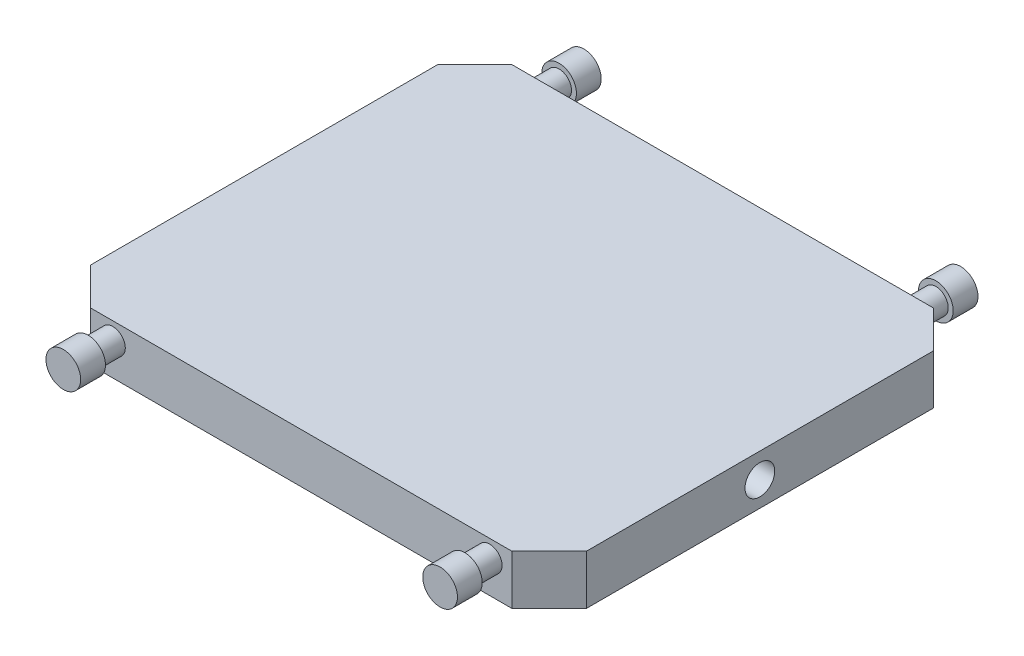
ISO-10303-21;
HEADER;
FILE_DESCRIPTION(('STEP AP214'),'2;1');
FILE_NAME('part.step','',(''),(''),'','','');
FILE_SCHEMA(('AUTOMOTIVE_DESIGN { 1 0 10303 214 1 1 1 1 }'));
ENDSEC;
DATA;
#1=APPLICATION_CONTEXT('core data for automotive mechanical design processes');
#2=APPLICATION_PROTOCOL_DEFINITION('international standard','automotive_design',2000,#1);
#3=PRODUCT_CONTEXT('',#1,'mechanical');
#4=PRODUCT('Part','Part','',(#3));
#5=PRODUCT_RELATED_PRODUCT_CATEGORY('part','',(#4));
#6=PRODUCT_DEFINITION_FORMATION('','',#4);
#7=PRODUCT_DEFINITION_CONTEXT('part definition',#1,'design');
#8=PRODUCT_DEFINITION('design','',#6,#7);
#9=PRODUCT_DEFINITION_SHAPE('','',#8);
#10=(LENGTH_UNIT() NAMED_UNIT(*) SI_UNIT(.MILLI.,.METRE.));
#11=(NAMED_UNIT(*) PLANE_ANGLE_UNIT() SI_UNIT($,.RADIAN.));
#12=(NAMED_UNIT(*) SI_UNIT($,.STERADIAN.) SOLID_ANGLE_UNIT());
#13=UNCERTAINTY_MEASURE_WITH_UNIT(LENGTH_MEASURE(1.E-05),#10,'distance_accuracy_value','');
#14=(GEOMETRIC_REPRESENTATION_CONTEXT(3) GLOBAL_UNCERTAINTY_ASSIGNED_CONTEXT((#13)) GLOBAL_UNIT_ASSIGNED_CONTEXT((#10,
#11,#12)) REPRESENTATION_CONTEXT('',''));
#15=CARTESIAN_POINT('',(0.,0.,0.));
#16=DIRECTION('',(0.,0.,1.));
#17=DIRECTION('',(1.,0.,0.));
#18=AXIS2_PLACEMENT_3D('',#15,#16,#17);
#19=CARTESIAN_POINT('',(0.,40.,-30.));
#20=DIRECTION('',(1.,0.,0.));
#21=DIRECTION('',(0.,0.,-1.));
#22=AXIS2_PLACEMENT_3D('',#19,#20,#21);
#23=PLANE('',#22);
#24=CARTESIAN_POINT('',(0.,20.,-170.));
#25=DIRECTION('',(-1.,0.,0.));
#26=DIRECTION('',(0.,0.,1.));
#27=AXIS2_PLACEMENT_3D('',#24,#25,#26);
#28=CIRCLE('',#27,12.);
#29=CARTESIAN_POINT('',(0.,20.,-158.));
#30=VERTEX_POINT('',#29);
#31=EDGE_CURVE('E191',#30,#30,#28,.T.);
#32=ORIENTED_EDGE('',*,*,#31,.F.);
#33=EDGE_LOOP('',(#32));
#34=FACE_BOUND('',#33,.T.);
#35=DIRECTION('',(0.,0.,1.));
#36=VECTOR('',#35,1.);
#37=CARTESIAN_POINT('',(0.,0.,-30.));
#38=LINE('',#37,#36);
#39=CARTESIAN_POINT('',(0.,0.,-310.));
#40=VERTEX_POINT('',#39);
#41=CARTESIAN_POINT('',(0.,0.,-30.));
#42=VERTEX_POINT('',#41);
#43=EDGE_CURVE('E130',#40,#42,#38,.T.);
#44=ORIENTED_EDGE('',*,*,#43,.T.);
#45=DIRECTION('',(0.,-1.,0.));
#46=VECTOR('',#45,1.);
#47=CARTESIAN_POINT('',(0.,40.,-30.));
#48=LINE('',#47,#46);
#49=CARTESIAN_POINT('',(0.,40.,-30.));
#50=VERTEX_POINT('',#49);
#51=EDGE_CURVE('E158',#50,#42,#48,.T.);
#52=ORIENTED_EDGE('',*,*,#51,.F.);
#53=DIRECTION('',(0.,0.,1.));
#54=VECTOR('',#53,1.);
#55=CARTESIAN_POINT('',(0.,40.,-30.));
#56=LINE('',#55,#54);
#57=CARTESIAN_POINT('',(0.,40.,-310.));
#58=VERTEX_POINT('',#57);
#59=EDGE_CURVE('E145',#58,#50,#56,.T.);
#60=ORIENTED_EDGE('',*,*,#59,.F.);
#61=DIRECTION('',(0.,-1.,0.));
#62=VECTOR('',#61,1.);
#63=CARTESIAN_POINT('',(0.,40.,-310.));
#64=LINE('',#63,#62);
#65=EDGE_CURVE('E126',#58,#40,#64,.T.);
#66=ORIENTED_EDGE('',*,*,#65,.T.);
#67=EDGE_LOOP('',(#44,#52,#60,#66));
#68=FACE_BOUND('',#67,.T.);
#69=ADVANCED_FACE('F33',(#34,#68),#23,.F.);
#70=CARTESIAN_POINT('',(0.,40.,-30.));
#71=DIRECTION('',(0.707106781186548,0.,-0.707106781186548));
#72=DIRECTION('',(-0.707106781186548,0.,-0.707106781186548));
#73=AXIS2_PLACEMENT_3D('',#70,#71,#72);
#74=PLANE('',#73);
#75=DIRECTION('',(0.707106781186547,0.,0.707106781186547));
#76=VECTOR('',#75,1.);
#77=CARTESIAN_POINT('',(0.,0.,-30.));
#78=LINE('',#77,#76);
#79=CARTESIAN_POINT('',(30.,0.,0.));
#80=VERTEX_POINT('',#79);
#81=EDGE_CURVE('E133',#42,#80,#78,.T.);
#82=ORIENTED_EDGE('',*,*,#81,.T.);
#83=DIRECTION('',(0.,-1.,0.));
#84=VECTOR('',#83,1.);
#85=CARTESIAN_POINT('',(30.,40.,0.));
#86=LINE('',#85,#84);
#87=CARTESIAN_POINT('',(30.,40.,0.));
#88=VERTEX_POINT('',#87);
#89=EDGE_CURVE('E155',#88,#80,#86,.T.);
#90=ORIENTED_EDGE('',*,*,#89,.F.);
#91=DIRECTION('',(0.707106781186547,0.,0.707106781186547));
#92=VECTOR('',#91,1.);
#93=CARTESIAN_POINT('',(0.,40.,-30.));
#94=LINE('',#93,#92);
#95=EDGE_CURVE('E93',#50,#88,#94,.T.);
#96=ORIENTED_EDGE('',*,*,#95,.F.);
#97=ORIENTED_EDGE('',*,*,#51,.T.);
#98=EDGE_LOOP('',(#82,#90,#96,#97));
#99=FACE_BOUND('',#98,.T.);
#100=ADVANCED_FACE('F168',(#99),#74,.F.);
#101=CARTESIAN_POINT('',(30.,40.,0.));
#102=DIRECTION('',(0.,0.,-1.));
#103=DIRECTION('',(-1.,0.,0.));
#104=AXIS2_PLACEMENT_3D('',#101,#102,#103);
#105=PLANE('',#104);
#106=CARTESIAN_POINT('',(352.,26.,0.));
#107=DIRECTION('',(0.,0.,-1.));
#108=DIRECTION('',(-1.,0.,0.));
#109=AXIS2_PLACEMENT_3D('',#106,#107,#108);
#110=CIRCLE('',#109,9.99999999999993);
#111=CARTESIAN_POINT('',(342.,26.,0.));
#112=VERTEX_POINT('',#111);
#113=EDGE_CURVE('E11',#112,#112,#110,.F.);
#114=ORIENTED_EDGE('',*,*,#113,.F.);
#115=EDGE_LOOP('',(#114));
#116=FACE_BOUND('',#115,.T.);
#117=CARTESIAN_POINT('',(48.,26.,0.));
#118=DIRECTION('',(0.,0.,-1.));
#119=DIRECTION('',(-1.,0.,0.));
#120=AXIS2_PLACEMENT_3D('',#117,#118,#119);
#121=CIRCLE('',#120,10.);
#122=CARTESIAN_POINT('',(38.,26.,0.));
#123=VERTEX_POINT('',#122);
#124=EDGE_CURVE('E41',#123,#123,#121,.F.);
#125=ORIENTED_EDGE('',*,*,#124,.F.);
#126=EDGE_LOOP('',(#125));
#127=FACE_BOUND('',#126,.T.);
#128=DIRECTION('',(1.,0.,0.));
#129=VECTOR('',#128,1.);
#130=CARTESIAN_POINT('',(30.,0.,0.));
#131=LINE('',#130,#129);
#132=CARTESIAN_POINT('',(370.,0.,0.));
#133=VERTEX_POINT('',#132);
#134=EDGE_CURVE('E136',#80,#133,#131,.T.);
#135=ORIENTED_EDGE('',*,*,#134,.T.);
#136=DIRECTION('',(0.,-1.,0.));
#137=VECTOR('',#136,1.);
#138=CARTESIAN_POINT('',(370.,40.,0.));
#139=LINE('',#138,#137);
#140=CARTESIAN_POINT('',(370.,40.,0.));
#141=VERTEX_POINT('',#140);
#142=EDGE_CURVE('E152',#141,#133,#139,.T.);
#143=ORIENTED_EDGE('',*,*,#142,.F.);
#144=DIRECTION('',(1.,0.,0.));
#145=VECTOR('',#144,1.);
#146=CARTESIAN_POINT('',(30.,40.,0.));
#147=LINE('',#146,#145);
#148=EDGE_CURVE('E185',#88,#141,#147,.T.);
#149=ORIENTED_EDGE('',*,*,#148,.F.);
#150=ORIENTED_EDGE('',*,*,#89,.T.);
#151=EDGE_LOOP('',(#135,#143,#149,#150));
#152=FACE_BOUND('',#151,.T.);
#153=ADVANCED_FACE('F164',(#116,#127,#152),#105,.F.);
#154=CARTESIAN_POINT('',(370.,40.,0.));
#155=DIRECTION('',(-0.707106781186547,0.,-0.707106781186548));
#156=DIRECTION('',(-0.707106781186548,0.,0.707106781186547));
#157=AXIS2_PLACEMENT_3D('',#154,#155,#156);
#158=PLANE('',#157);
#159=DIRECTION('',(0.707106781186548,0.,-0.707106781186547));
#160=VECTOR('',#159,1.);
#161=CARTESIAN_POINT('',(370.,0.,0.));
#162=LINE('',#161,#160);
#163=CARTESIAN_POINT('',(400.,0.,-30.));
#164=VERTEX_POINT('',#163);
#165=EDGE_CURVE('E138',#133,#164,#162,.T.);
#166=ORIENTED_EDGE('',*,*,#165,.T.);
#167=DIRECTION('',(0.,-1.,0.));
#168=VECTOR('',#167,1.);
#169=CARTESIAN_POINT('',(400.,40.,-30.));
#170=LINE('',#169,#168);
#171=CARTESIAN_POINT('',(400.,40.,-30.));
#172=VERTEX_POINT('',#171);
#173=EDGE_CURVE('E149',#172,#164,#170,.T.);
#174=ORIENTED_EDGE('',*,*,#173,.F.);
#175=DIRECTION('',(0.707106781186548,0.,-0.707106781186547));
#176=VECTOR('',#175,1.);
#177=CARTESIAN_POINT('',(370.,40.,0.));
#178=LINE('',#177,#176);
#179=EDGE_CURVE('E179',#141,#172,#178,.T.);
#180=ORIENTED_EDGE('',*,*,#179,.F.);
#181=ORIENTED_EDGE('',*,*,#142,.T.);
#182=EDGE_LOOP('',(#166,#174,#180,#181));
#183=FACE_BOUND('',#182,.T.);
#184=ADVANCED_FACE('F167',(#183),#158,.F.);
#185=CARTESIAN_POINT('',(400.,40.,-30.));
#186=DIRECTION('',(-1.,0.,0.));
#187=DIRECTION('',(0.,0.,1.));
#188=AXIS2_PLACEMENT_3D('',#185,#186,#187);
#189=PLANE('',#188);
#190=CARTESIAN_POINT('',(400.,20.,-170.));
#191=DIRECTION('',(-1.,0.,0.));
#192=DIRECTION('',(0.,0.,1.));
#193=AXIS2_PLACEMENT_3D('',#190,#191,#192);
#194=CIRCLE('',#193,12.);
#195=CARTESIAN_POINT('',(400.,20.,-158.));
#196=VERTEX_POINT('',#195);
#197=EDGE_CURVE('E134',#196,#196,#194,.T.);
#198=ORIENTED_EDGE('',*,*,#197,.T.);
#199=EDGE_LOOP('',(#198));
#200=FACE_BOUND('',#199,.T.);
#201=DIRECTION('',(0.,0.,-1.));
#202=VECTOR('',#201,1.);
#203=CARTESIAN_POINT('',(400.,0.,-30.));
#204=LINE('',#203,#202);
#205=CARTESIAN_POINT('',(400.,0.,-310.));
#206=VERTEX_POINT('',#205);
#207=EDGE_CURVE('E140',#164,#206,#204,.T.);
#208=ORIENTED_EDGE('',*,*,#207,.T.);
#209=DIRECTION('',(0.,-1.,0.));
#210=VECTOR('',#209,1.);
#211=CARTESIAN_POINT('',(400.,40.,-310.));
#212=LINE('',#211,#210);
#213=CARTESIAN_POINT('',(400.,40.,-310.));
#214=VERTEX_POINT('',#213);
#215=EDGE_CURVE('E121',#214,#206,#212,.T.);
#216=ORIENTED_EDGE('',*,*,#215,.F.);
#217=DIRECTION('',(0.,0.,-1.));
#218=VECTOR('',#217,1.);
#219=CARTESIAN_POINT('',(400.,40.,-30.));
#220=LINE('',#219,#218);
#221=EDGE_CURVE('E112',#172,#214,#220,.T.);
#222=ORIENTED_EDGE('',*,*,#221,.F.);
#223=ORIENTED_EDGE('',*,*,#173,.T.);
#224=EDGE_LOOP('',(#208,#216,#222,#223));
#225=FACE_BOUND('',#224,.T.);
#226=ADVANCED_FACE('F184',(#200,#225),#189,.F.);
#227=CARTESIAN_POINT('',(370.,40.,-340.));
#228=DIRECTION('',(-0.707106781186547,0.,0.707106781186548));
#229=DIRECTION('',(0.707106781186548,0.,0.707106781186547));
#230=AXIS2_PLACEMENT_3D('',#227,#228,#229);
#231=PLANE('',#230);
#232=DIRECTION('',(-0.707106781186548,0.,-0.707106781186547));
#233=VECTOR('',#232,1.);
#234=CARTESIAN_POINT('',(370.,0.,-340.));
#235=LINE('',#234,#233);
#236=CARTESIAN_POINT('',(370.,0.,-340.));
#237=VERTEX_POINT('',#236);
#238=EDGE_CURVE('E120',#206,#237,#235,.T.);
#239=ORIENTED_EDGE('',*,*,#238,.T.);
#240=DIRECTION('',(0.,-1.,0.));
#241=VECTOR('',#240,1.);
#242=CARTESIAN_POINT('',(370.,40.,-340.));
#243=LINE('',#242,#241);
#244=CARTESIAN_POINT('',(370.,40.,-340.));
#245=VERTEX_POINT('',#244);
#246=EDGE_CURVE('E117',#245,#237,#243,.T.);
#247=ORIENTED_EDGE('',*,*,#246,.F.);
#248=DIRECTION('',(-0.707106781186548,0.,-0.707106781186547));
#249=VECTOR('',#248,1.);
#250=CARTESIAN_POINT('',(370.,40.,-340.));
#251=LINE('',#250,#249);
#252=EDGE_CURVE('E106',#214,#245,#251,.T.);
#253=ORIENTED_EDGE('',*,*,#252,.F.);
#254=ORIENTED_EDGE('',*,*,#215,.T.);
#255=EDGE_LOOP('',(#239,#247,#253,#254));
#256=FACE_BOUND('',#255,.T.);
#257=ADVANCED_FACE('F118',(#256),#231,.F.);
#258=CARTESIAN_POINT('',(30.,40.,-340.));
#259=DIRECTION('',(0.,0.,1.));
#260=DIRECTION('',(1.,0.,0.));
#261=AXIS2_PLACEMENT_3D('',#258,#259,#260);
#262=PLANE('',#261);
#263=CARTESIAN_POINT('',(352.,26.,-340.));
#264=DIRECTION('',(0.,0.,1.));
#265=DIRECTION('',(-1.,0.,0.));
#266=AXIS2_PLACEMENT_3D('',#263,#264,#265);
#267=CIRCLE('',#266,9.99999999999993);
#268=CARTESIAN_POINT('',(342.,26.,-340.));
#269=VERTEX_POINT('',#268);
#270=EDGE_CURVE('E217',#269,#269,#267,.T.);
#271=ORIENTED_EDGE('',*,*,#270,.T.);
#272=EDGE_LOOP('',(#271));
#273=FACE_BOUND('',#272,.T.);
#274=CARTESIAN_POINT('',(48.,26.,-340.));
#275=DIRECTION('',(0.,0.,1.));
#276=DIRECTION('',(1.,0.,0.));
#277=AXIS2_PLACEMENT_3D('',#274,#275,#276);
#278=CIRCLE('',#277,10.);
#279=CARTESIAN_POINT('',(58.,26.,-340.));
#280=VERTEX_POINT('',#279);
#281=EDGE_CURVE('E212',#280,#280,#278,.T.);
#282=ORIENTED_EDGE('',*,*,#281,.T.);
#283=EDGE_LOOP('',(#282));
#284=FACE_BOUND('',#283,.T.);
#285=DIRECTION('',(-1.,0.,0.));
#286=VECTOR('',#285,1.);
#287=CARTESIAN_POINT('',(30.,0.,-340.));
#288=LINE('',#287,#286);
#289=CARTESIAN_POINT('',(30.,0.,-340.));
#290=VERTEX_POINT('',#289);
#291=EDGE_CURVE('E78',#237,#290,#288,.T.);
#292=ORIENTED_EDGE('',*,*,#291,.T.);
#293=DIRECTION('',(0.,-1.,0.));
#294=VECTOR('',#293,1.);
#295=CARTESIAN_POINT('',(30.,40.,-340.));
#296=LINE('',#295,#294);
#297=CARTESIAN_POINT('',(30.,40.,-340.));
#298=VERTEX_POINT('',#297);
#299=EDGE_CURVE('E122',#298,#290,#296,.T.);
#300=ORIENTED_EDGE('',*,*,#299,.F.);
#301=DIRECTION('',(-1.,0.,0.));
#302=VECTOR('',#301,1.);
#303=CARTESIAN_POINT('',(30.,40.,-340.));
#304=LINE('',#303,#302);
#305=EDGE_CURVE('E110',#245,#298,#304,.T.);
#306=ORIENTED_EDGE('',*,*,#305,.F.);
#307=ORIENTED_EDGE('',*,*,#246,.T.);
#308=EDGE_LOOP('',(#292,#300,#306,#307));
#309=FACE_BOUND('',#308,.T.);
#310=ADVANCED_FACE('F124',(#273,#284,#309),#262,.F.);
#311=CARTESIAN_POINT('',(0.,40.,-310.));
#312=DIRECTION('',(0.707106781186547,0.,0.707106781186548));
#313=DIRECTION('',(0.707106781186548,0.,-0.707106781186547));
#314=AXIS2_PLACEMENT_3D('',#311,#312,#313);
#315=PLANE('',#314);
#316=DIRECTION('',(-0.707106781186548,0.,0.707106781186547));
#317=VECTOR('',#316,1.);
#318=CARTESIAN_POINT('',(0.,0.,-310.));
#319=LINE('',#318,#317);
#320=EDGE_CURVE('E84',#290,#40,#319,.T.);
#321=ORIENTED_EDGE('',*,*,#320,.T.);
#322=ORIENTED_EDGE('',*,*,#65,.F.);
#323=DIRECTION('',(-0.707106781186548,0.,0.707106781186547));
#324=VECTOR('',#323,1.);
#325=CARTESIAN_POINT('',(0.,40.,-310.));
#326=LINE('',#325,#324);
#327=EDGE_CURVE('E49',#298,#58,#326,.T.);
#328=ORIENTED_EDGE('',*,*,#327,.F.);
#329=ORIENTED_EDGE('',*,*,#299,.T.);
#330=EDGE_LOOP('',(#321,#322,#328,#329));
#331=FACE_BOUND('',#330,.T.);
#332=ADVANCED_FACE('F263',(#331),#315,.F.);
#333=CARTESIAN_POINT('',(0.,40.,0.));
#334=DIRECTION('',(0.,-1.,0.));
#335=DIRECTION('',(0.,0.,-1.));
#336=AXIS2_PLACEMENT_3D('',#333,#334,#335);
#337=PLANE('',#336);
#338=ORIENTED_EDGE('',*,*,#59,.T.);
#339=ORIENTED_EDGE('',*,*,#95,.T.);
#340=ORIENTED_EDGE('',*,*,#148,.T.);
#341=ORIENTED_EDGE('',*,*,#179,.T.);
#342=ORIENTED_EDGE('',*,*,#221,.T.);
#343=ORIENTED_EDGE('',*,*,#252,.T.);
#344=ORIENTED_EDGE('',*,*,#305,.T.);
#345=ORIENTED_EDGE('',*,*,#327,.T.);
#346=EDGE_LOOP('',(#338,#339,#340,#341,#342,#343,#344,#345));
#347=FACE_BOUND('',#346,.T.);
#348=ADVANCED_FACE('F108',(#347),#337,.F.);
#349=CARTESIAN_POINT('',(0.,0.,0.));
#350=DIRECTION('',(0.,-1.,0.));
#351=DIRECTION('',(0.,0.,-1.));
#352=AXIS2_PLACEMENT_3D('',#349,#350,#351);
#353=PLANE('',#352);
#354=ORIENTED_EDGE('',*,*,#43,.F.);
#355=ORIENTED_EDGE('',*,*,#320,.F.);
#356=ORIENTED_EDGE('',*,*,#291,.F.);
#357=ORIENTED_EDGE('',*,*,#238,.F.);
#358=ORIENTED_EDGE('',*,*,#207,.F.);
#359=ORIENTED_EDGE('',*,*,#165,.F.);
#360=ORIENTED_EDGE('',*,*,#134,.F.);
#361=ORIENTED_EDGE('',*,*,#81,.F.);
#362=EDGE_LOOP('',(#354,#355,#356,#357,#358,#359,#360,#361));
#363=FACE_BOUND('',#362,.T.);
#364=ADVANCED_FACE('F182',(#363),#353,.T.);
#365=CARTESIAN_POINT('',(400.,20.,-170.));
#366=DIRECTION('',(-1.,0.,0.));
#367=DIRECTION('',(0.,0.,1.));
#368=AXIS2_PLACEMENT_3D('',#365,#366,#367);
#369=CYLINDRICAL_SURFACE('',#368,12.);
#370=ORIENTED_EDGE('',*,*,#197,.F.);
#371=EDGE_LOOP('',(#370));
#372=FACE_BOUND('',#371,.T.);
#373=ORIENTED_EDGE('',*,*,#31,.T.);
#374=EDGE_LOOP('',(#373));
#375=FACE_BOUND('',#374,.T.);
#376=ADVANCED_FACE('F406',(#372,#375),#369,.F.);
#377=CARTESIAN_POINT('',(48.,26.,20.));
#378=DIRECTION('',(0.,0.,-1.));
#379=DIRECTION('',(-1.,0.,0.));
#380=AXIS2_PLACEMENT_3D('',#377,#378,#379);
#381=CYLINDRICAL_SURFACE('',#380,10.);
#382=CARTESIAN_POINT('',(48.,26.,20.));
#383=DIRECTION('',(0.,0.,1.));
#384=DIRECTION('',(1.,0.,0.));
#385=AXIS2_PLACEMENT_3D('',#382,#383,#384);
#386=CIRCLE('',#385,10.);
#387=CARTESIAN_POINT('',(58.,26.,20.));
#388=VERTEX_POINT('',#387);
#389=EDGE_CURVE('E194',#388,#388,#386,.T.);
#390=ORIENTED_EDGE('',*,*,#389,.F.);
#391=EDGE_LOOP('',(#390));
#392=FACE_BOUND('',#391,.T.);
#393=ORIENTED_EDGE('',*,*,#124,.T.);
#394=EDGE_LOOP('',(#393));
#395=FACE_BOUND('',#394,.T.);
#396=ADVANCED_FACE('F162',(#392,#395),#381,.T.);
#397=CARTESIAN_POINT('',(352.,26.,20.));
#398=DIRECTION('',(0.,0.,-1.));
#399=DIRECTION('',(-1.,0.,0.));
#400=AXIS2_PLACEMENT_3D('',#397,#398,#399);
#401=CYLINDRICAL_SURFACE('',#400,9.99999999999993);
#402=CARTESIAN_POINT('',(352.,26.,20.));
#403=DIRECTION('',(0.,0.,1.));
#404=DIRECTION('',(-1.,0.,0.));
#405=AXIS2_PLACEMENT_3D('',#402,#403,#404);
#406=CIRCLE('',#405,9.99999999999993);
#407=CARTESIAN_POINT('',(342.,26.,20.));
#408=VERTEX_POINT('',#407);
#409=EDGE_CURVE('E199',#408,#408,#406,.T.);
#410=ORIENTED_EDGE('',*,*,#409,.F.);
#411=EDGE_LOOP('',(#410));
#412=FACE_BOUND('',#411,.T.);
#413=ORIENTED_EDGE('',*,*,#113,.T.);
#414=EDGE_LOOP('',(#413));
#415=FACE_BOUND('',#414,.T.);
#416=ADVANCED_FACE('F399',(#412,#415),#401,.T.);
#417=CARTESIAN_POINT('',(48.,26.,40.));
#418=DIRECTION('',(0.,0.,-1.));
#419=DIRECTION('',(-1.,0.,0.));
#420=AXIS2_PLACEMENT_3D('',#417,#418,#419);
#421=CYLINDRICAL_SURFACE('',#420,14.);
#422=CARTESIAN_POINT('',(48.,26.,40.));
#423=DIRECTION('',(0.,0.,1.));
#424=DIRECTION('',(1.,0.,0.));
#425=AXIS2_PLACEMENT_3D('',#422,#423,#424);
#426=CIRCLE('',#425,14.);
#427=CARTESIAN_POINT('',(62.,26.,40.));
#428=VERTEX_POINT('',#427);
#429=EDGE_CURVE('E202',#428,#428,#426,.T.);
#430=ORIENTED_EDGE('',*,*,#429,.F.);
#431=EDGE_LOOP('',(#430));
#432=FACE_BOUND('',#431,.T.);
#433=CARTESIAN_POINT('',(48.,26.,20.));
#434=DIRECTION('',(0.,0.,1.));
#435=DIRECTION('',(1.,0.,0.));
#436=AXIS2_PLACEMENT_3D('',#433,#434,#435);
#437=CIRCLE('',#436,14.);
#438=CARTESIAN_POINT('',(62.,26.,20.));
#439=VERTEX_POINT('',#438);
#440=EDGE_CURVE('E203',#439,#439,#437,.T.);
#441=ORIENTED_EDGE('',*,*,#440,.T.);
#442=EDGE_LOOP('',(#441));
#443=FACE_BOUND('',#442,.T.);
#444=ADVANCED_FACE('F392',(#432,#443),#421,.T.);
#445=CARTESIAN_POINT('',(48.,26.,40.));
#446=DIRECTION('',(0.,0.,1.));
#447=DIRECTION('',(1.,0.,0.));
#448=AXIS2_PLACEMENT_3D('',#445,#446,#447);
#449=PLANE('',#448);
#450=ORIENTED_EDGE('',*,*,#429,.T.);
#451=EDGE_LOOP('',(#450));
#452=FACE_BOUND('',#451,.T.);
#453=ADVANCED_FACE('F389',(#452),#449,.T.);
#454=CARTESIAN_POINT('',(48.,26.,20.));
#455=DIRECTION('',(0.,0.,1.));
#456=DIRECTION('',(1.,0.,0.));
#457=AXIS2_PLACEMENT_3D('',#454,#455,#456);
#458=PLANE('',#457);
#459=ORIENTED_EDGE('',*,*,#389,.T.);
#460=EDGE_LOOP('',(#459));
#461=FACE_BOUND('',#460,.T.);
#462=ORIENTED_EDGE('',*,*,#440,.F.);
#463=EDGE_LOOP('',(#462));
#464=FACE_BOUND('',#463,.T.);
#465=ADVANCED_FACE('F387',(#461,#464),#458,.F.);
#466=CARTESIAN_POINT('',(352.,26.,40.));
#467=DIRECTION('',(0.,0.,-1.));
#468=DIRECTION('',(-1.,0.,0.));
#469=AXIS2_PLACEMENT_3D('',#466,#467,#468);
#470=CYLINDRICAL_SURFACE('',#469,14.);
#471=CARTESIAN_POINT('',(352.,26.,40.));
#472=DIRECTION('',(0.,0.,1.));
#473=DIRECTION('',(1.,0.,0.));
#474=AXIS2_PLACEMENT_3D('',#471,#472,#473);
#475=CIRCLE('',#474,14.);
#476=CARTESIAN_POINT('',(366.,26.,40.));
#477=VERTEX_POINT('',#476);
#478=EDGE_CURVE('E206',#477,#477,#475,.T.);
#479=ORIENTED_EDGE('',*,*,#478,.F.);
#480=EDGE_LOOP('',(#479));
#481=FACE_BOUND('',#480,.T.);
#482=CARTESIAN_POINT('',(352.,26.,20.));
#483=DIRECTION('',(0.,0.,1.));
#484=DIRECTION('',(1.,0.,0.));
#485=AXIS2_PLACEMENT_3D('',#482,#483,#484);
#486=CIRCLE('',#485,14.);
#487=CARTESIAN_POINT('',(366.,26.,20.));
#488=VERTEX_POINT('',#487);
#489=EDGE_CURVE('E209',#488,#488,#486,.T.);
#490=ORIENTED_EDGE('',*,*,#489,.T.);
#491=EDGE_LOOP('',(#490));
#492=FACE_BOUND('',#491,.T.);
#493=ADVANCED_FACE('F381',(#481,#492),#470,.T.);
#494=CARTESIAN_POINT('',(352.,26.,40.));
#495=DIRECTION('',(0.,0.,1.));
#496=DIRECTION('',(1.,0.,0.));
#497=AXIS2_PLACEMENT_3D('',#494,#495,#496);
#498=PLANE('',#497);
#499=ORIENTED_EDGE('',*,*,#478,.T.);
#500=EDGE_LOOP('',(#499));
#501=FACE_BOUND('',#500,.T.);
#502=ADVANCED_FACE('F378',(#501),#498,.T.);
#503=CARTESIAN_POINT('',(352.,26.,20.));
#504=DIRECTION('',(0.,0.,1.));
#505=DIRECTION('',(1.,0.,0.));
#506=AXIS2_PLACEMENT_3D('',#503,#504,#505);
#507=PLANE('',#506);
#508=ORIENTED_EDGE('',*,*,#409,.T.);
#509=EDGE_LOOP('',(#508));
#510=FACE_BOUND('',#509,.T.);
#511=ORIENTED_EDGE('',*,*,#489,.F.);
#512=EDGE_LOOP('',(#511));
#513=FACE_BOUND('',#512,.T.);
#514=ADVANCED_FACE('F306',(#510,#513),#507,.F.);
#515=CARTESIAN_POINT('',(48.,26.,-360.));
#516=DIRECTION('',(0.,0.,1.));
#517=DIRECTION('',(1.,0.,0.));
#518=AXIS2_PLACEMENT_3D('',#515,#516,#517);
#519=CYLINDRICAL_SURFACE('',#518,10.);
#520=CARTESIAN_POINT('',(48.,26.,-360.));
#521=DIRECTION('',(0.,0.,-1.));
#522=DIRECTION('',(-1.,0.,0.));
#523=AXIS2_PLACEMENT_3D('',#520,#521,#522);
#524=CIRCLE('',#523,10.);
#525=CARTESIAN_POINT('',(38.,26.,-360.));
#526=VERTEX_POINT('',#525);
#527=EDGE_CURVE('E220',#526,#526,#524,.F.);
#528=ORIENTED_EDGE('',*,*,#527,.T.);
#529=EDGE_LOOP('',(#528));
#530=FACE_BOUND('',#529,.T.);
#531=ORIENTED_EDGE('',*,*,#281,.F.);
#532=EDGE_LOOP('',(#531));
#533=FACE_BOUND('',#532,.T.);
#534=ADVANCED_FACE('F311',(#530,#533),#519,.T.);
#535=CARTESIAN_POINT('',(352.,26.,-360.));
#536=DIRECTION('',(0.,0.,1.));
#537=DIRECTION('',(1.,0.,0.));
#538=AXIS2_PLACEMENT_3D('',#535,#536,#537);
#539=CYLINDRICAL_SURFACE('',#538,9.99999999999993);
#540=CARTESIAN_POINT('',(352.,26.,-360.));
#541=DIRECTION('',(0.,0.,-1.));
#542=DIRECTION('',(-1.,0.,0.));
#543=AXIS2_PLACEMENT_3D('',#540,#541,#542);
#544=CIRCLE('',#543,9.99999999999993);
#545=CARTESIAN_POINT('',(342.,26.,-360.));
#546=VERTEX_POINT('',#545);
#547=EDGE_CURVE('E227',#546,#546,#544,.F.);
#548=ORIENTED_EDGE('',*,*,#547,.T.);
#549=EDGE_LOOP('',(#548));
#550=FACE_BOUND('',#549,.T.);
#551=ORIENTED_EDGE('',*,*,#270,.F.);
#552=EDGE_LOOP('',(#551));
#553=FACE_BOUND('',#552,.T.);
#554=ADVANCED_FACE('F316',(#550,#553),#539,.T.);
#555=CARTESIAN_POINT('',(48.,26.,-380.));
#556=DIRECTION('',(0.,0.,1.));
#557=DIRECTION('',(1.,0.,0.));
#558=AXIS2_PLACEMENT_3D('',#555,#556,#557);
#559=CYLINDRICAL_SURFACE('',#558,14.);
#560=CARTESIAN_POINT('',(48.,26.,-380.));
#561=DIRECTION('',(0.,0.,1.));
#562=DIRECTION('',(1.,0.,0.));
#563=AXIS2_PLACEMENT_3D('',#560,#561,#562);
#564=CIRCLE('',#563,14.);
#565=CARTESIAN_POINT('',(62.,26.,-380.));
#566=VERTEX_POINT('',#565);
#567=EDGE_CURVE('E223',#566,#566,#564,.T.);
#568=ORIENTED_EDGE('',*,*,#567,.T.);
#569=EDGE_LOOP('',(#568));
#570=FACE_BOUND('',#569,.T.);
#571=CARTESIAN_POINT('',(48.,26.,-360.));
#572=DIRECTION('',(0.,0.,1.));
#573=DIRECTION('',(1.,0.,0.));
#574=AXIS2_PLACEMENT_3D('',#571,#572,#573);
#575=CIRCLE('',#574,14.);
#576=CARTESIAN_POINT('',(62.,26.,-360.));
#577=VERTEX_POINT('',#576);
#578=EDGE_CURVE('E224',#577,#577,#575,.T.);
#579=ORIENTED_EDGE('',*,*,#578,.F.);
#580=EDGE_LOOP('',(#579));
#581=FACE_BOUND('',#580,.T.);
#582=ADVANCED_FACE('F326',(#570,#581),#559,.T.);
#583=CARTESIAN_POINT('',(48.,26.,-380.));
#584=DIRECTION('',(0.,0.,-1.));
#585=DIRECTION('',(1.,0.,0.));
#586=AXIS2_PLACEMENT_3D('',#583,#584,#585);
#587=PLANE('',#586);
#588=ORIENTED_EDGE('',*,*,#567,.F.);
#589=EDGE_LOOP('',(#588));
#590=FACE_BOUND('',#589,.T.);
#591=ADVANCED_FACE('F336',(#590),#587,.T.);
#592=CARTESIAN_POINT('',(48.,26.,-360.));
#593=DIRECTION('',(0.,0.,-1.));
#594=DIRECTION('',(1.,0.,0.));
#595=AXIS2_PLACEMENT_3D('',#592,#593,#594);
#596=PLANE('',#595);
#597=ORIENTED_EDGE('',*,*,#527,.F.);
#598=EDGE_LOOP('',(#597));
#599=FACE_BOUND('',#598,.T.);
#600=ORIENTED_EDGE('',*,*,#578,.T.);
#601=EDGE_LOOP('',(#600));
#602=FACE_BOUND('',#601,.T.);
#603=ADVANCED_FACE('F252',(#599,#602),#596,.F.);
#604=CARTESIAN_POINT('',(352.,26.,-380.));
#605=DIRECTION('',(0.,0.,1.));
#606=DIRECTION('',(1.,0.,0.));
#607=AXIS2_PLACEMENT_3D('',#604,#605,#606);
#608=CYLINDRICAL_SURFACE('',#607,14.);
#609=CARTESIAN_POINT('',(352.,26.,-380.));
#610=DIRECTION('',(0.,0.,1.));
#611=DIRECTION('',(1.,0.,0.));
#612=AXIS2_PLACEMENT_3D('',#609,#610,#611);
#613=CIRCLE('',#612,14.);
#614=CARTESIAN_POINT('',(366.,26.,-380.));
#615=VERTEX_POINT('',#614);
#616=EDGE_CURVE('E232',#615,#615,#613,.T.);
#617=ORIENTED_EDGE('',*,*,#616,.T.);
#618=EDGE_LOOP('',(#617));
#619=FACE_BOUND('',#618,.T.);
#620=CARTESIAN_POINT('',(352.,26.,-360.));
#621=DIRECTION('',(0.,0.,1.));
#622=DIRECTION('',(1.,0.,0.));
#623=AXIS2_PLACEMENT_3D('',#620,#621,#622);
#624=CIRCLE('',#623,14.);
#625=CARTESIAN_POINT('',(366.,26.,-360.));
#626=VERTEX_POINT('',#625);
#627=EDGE_CURVE('E233',#626,#626,#624,.T.);
#628=ORIENTED_EDGE('',*,*,#627,.F.);
#629=EDGE_LOOP('',(#628));
#630=FACE_BOUND('',#629,.T.);
#631=ADVANCED_FACE('F239',(#619,#630),#608,.T.);
#632=CARTESIAN_POINT('',(352.,26.,-380.));
#633=DIRECTION('',(0.,0.,-1.));
#634=DIRECTION('',(1.,0.,0.));
#635=AXIS2_PLACEMENT_3D('',#632,#633,#634);
#636=PLANE('',#635);
#637=ORIENTED_EDGE('',*,*,#616,.F.);
#638=EDGE_LOOP('',(#637));
#639=FACE_BOUND('',#638,.T.);
#640=ADVANCED_FACE('F242',(#639),#636,.T.);
#641=CARTESIAN_POINT('',(352.,26.,-360.));
#642=DIRECTION('',(0.,0.,-1.));
#643=DIRECTION('',(1.,0.,0.));
#644=AXIS2_PLACEMENT_3D('',#641,#642,#643);
#645=PLANE('',#644);
#646=ORIENTED_EDGE('',*,*,#547,.F.);
#647=EDGE_LOOP('',(#646));
#648=FACE_BOUND('',#647,.T.);
#649=ORIENTED_EDGE('',*,*,#627,.T.);
#650=EDGE_LOOP('',(#649));
#651=FACE_BOUND('',#650,.T.);
#652=ADVANCED_FACE('F244',(#648,#651),#645,.F.);
#653=CLOSED_SHELL('',(#69,#100,#153,#184,#226,#257,#310,#332,#348,#364,#376,#396,#416,#444,#453,
#465,#493,#502,#514,#534,#554,#582,#591,#603,#631,#640,#652));
#654=MANIFOLD_SOLID_BREP('B2',#653);
#655=ADVANCED_BREP_SHAPE_REPRESENTATION('',(#18,#654),#14);
#656=SHAPE_DEFINITION_REPRESENTATION(#9,#655);
ENDSEC;
END-ISO-10303-21;
